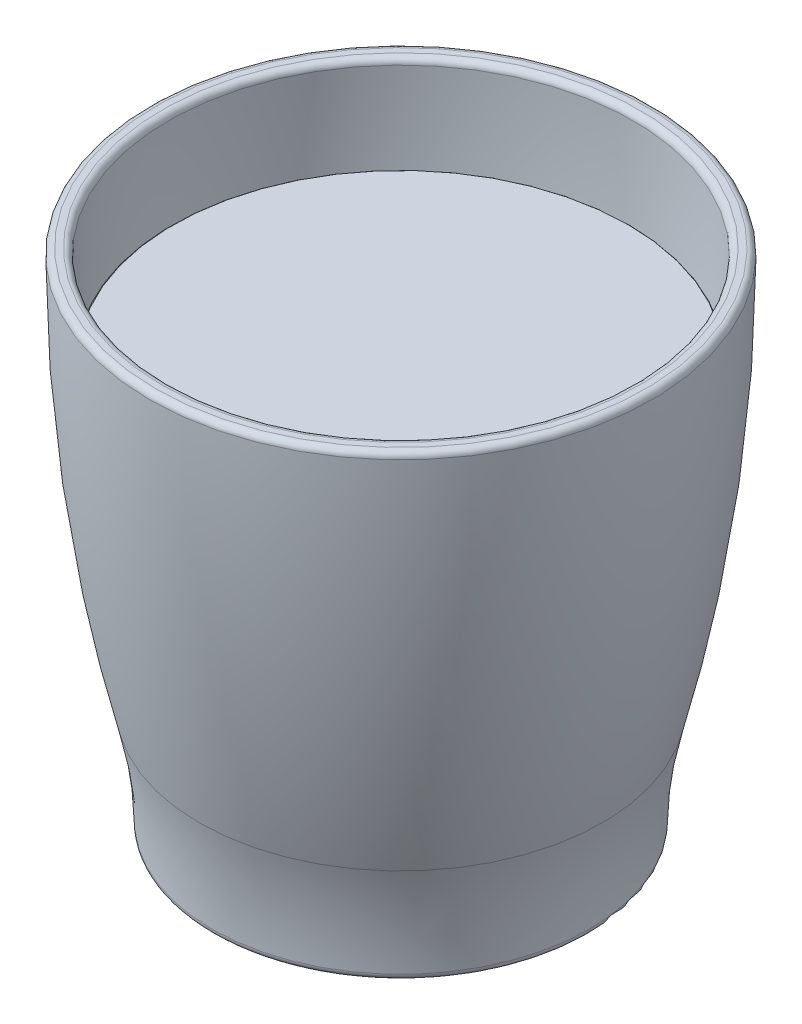
ISO-10303-21;
HEADER;
FILE_DESCRIPTION(('STEP AP214'),'2;1');
FILE_NAME('part.step','',(''),(''),'','','');
FILE_SCHEMA(('AUTOMOTIVE_DESIGN { 1 0 10303 214 1 1 1 1 }'));
ENDSEC;
DATA;
#1=APPLICATION_CONTEXT('core data for automotive mechanical design processes');
#2=APPLICATION_PROTOCOL_DEFINITION('international standard','automotive_design',2000,#1);
#3=PRODUCT_CONTEXT('',#1,'mechanical');
#4=PRODUCT('Part','Part','',(#3));
#5=PRODUCT_RELATED_PRODUCT_CATEGORY('part','',(#4));
#6=PRODUCT_DEFINITION_FORMATION('','',#4);
#7=PRODUCT_DEFINITION_CONTEXT('part definition',#1,'design');
#8=PRODUCT_DEFINITION('design','',#6,#7);
#9=PRODUCT_DEFINITION_SHAPE('','',#8);
#10=(LENGTH_UNIT() NAMED_UNIT(*) SI_UNIT(.MILLI.,.METRE.));
#11=(NAMED_UNIT(*) PLANE_ANGLE_UNIT() SI_UNIT($,.RADIAN.));
#12=(NAMED_UNIT(*) SI_UNIT($,.STERADIAN.) SOLID_ANGLE_UNIT());
#13=UNCERTAINTY_MEASURE_WITH_UNIT(LENGTH_MEASURE(1.E-05),#10,'distance_accuracy_value','');
#14=(GEOMETRIC_REPRESENTATION_CONTEXT(3) GLOBAL_UNCERTAINTY_ASSIGNED_CONTEXT((#13)) GLOBAL_UNIT_ASSIGNED_CONTEXT((#10,
#11,#12)) REPRESENTATION_CONTEXT('',''));
#15=CARTESIAN_POINT('',(0.,0.,0.));
#16=DIRECTION('',(0.,0.,1.));
#17=DIRECTION('',(1.,0.,0.));
#18=AXIS2_PLACEMENT_3D('',#15,#16,#17);
#19=CARTESIAN_POINT('',(0.,79.9999999999992,0.));
#20=DIRECTION('',(0.,-1.,0.));
#21=DIRECTION('',(0.,0.,-1.));
#22=AXIS2_PLACEMENT_3D('',#19,#20,#21);
#23=DEGENERATE_TOROIDAL_SURFACE('',#22,217.427109120294,254.227109120296,.F.);
#24=CARTESIAN_POINT('',(0.,64.8940580916171,0.));
#25=DIRECTION('',(0.,1.,0.));
#26=DIRECTION('',(0.,0.,1.));
#27=AXIS2_PLACEMENT_3D('',#24,#25,#26);
#28=CIRCLE('',#27,36.3508125567568);
#29=CARTESIAN_POINT('',(0.,64.8940580916171,36.3508125567568));
#30=VERTEX_POINT('',#29);
#31=EDGE_CURVE('E47',#30,#30,#28,.F.);
#32=ORIENTED_EDGE('',*,*,#31,.T.);
#33=EDGE_LOOP('',(#32));
#34=FACE_BOUND('',#33,.T.);
#35=CARTESIAN_POINT('',(0.,17.4936707648138,0.));
#36=DIRECTION('',(0.,-1.,0.));
#37=DIRECTION('',(0.,0.,-1.));
#38=AXIS2_PLACEMENT_3D('',#35,#36,#37);
#39=CIRCLE('',#38,28.9960671785382);
#40=CARTESIAN_POINT('',(0.,17.4936707648138,-28.9960671785382));
#41=VERTEX_POINT('',#40);
#42=EDGE_CURVE('E51',#41,#41,#39,.T.);
#43=ORIENTED_EDGE('',*,*,#42,.F.);
#44=EDGE_LOOP('',(#43));
#45=FACE_BOUND('',#44,.T.);
#46=ADVANCED_FACE('F40',(#34,#45),#23,.F.);
#47=CARTESIAN_POINT('',(0.,0.,0.));
#48=DIRECTION('',(0.,-1.,0.));
#49=DIRECTION('',(0.,0.,-1.));
#50=AXIS2_PLACEMENT_3D('',#47,#48,#49);
#51=TOROIDAL_SURFACE('',#50,97.9626177301071,71.1506402768788);
#52=CARTESIAN_POINT('',(0.,15.5049828231198,0.));
#53=DIRECTION('',(0.,-1.,0.));
#54=DIRECTION('',(0.,0.,-1.));
#55=AXIS2_PLACEMENT_3D('',#52,#53,#54);
#56=CIRCLE('',#55,28.5219299493502);
#57=CARTESIAN_POINT('',(0.,15.5049828231198,-28.5219299493502));
#58=VERTEX_POINT('',#57);
#59=EDGE_CURVE('E55',#58,#58,#56,.T.);
#60=ORIENTED_EDGE('',*,*,#59,.F.);
#61=EDGE_LOOP('',(#60));
#62=FACE_BOUND('',#61,.T.);
#63=ORIENTED_EDGE('',*,*,#42,.T.);
#64=EDGE_LOOP('',(#63));
#65=FACE_BOUND('',#64,.T.);
#66=ADVANCED_FACE('F78',(#62,#65),#51,.F.);
#67=CARTESIAN_POINT('',(0.,17.6405761371824,0.));
#68=DIRECTION('',(0.,-1.,0.));
#69=DIRECTION('',(0.,0.,-1.));
#70=AXIS2_PLACEMENT_3D('',#67,#68,#69);
#71=TOROIDAL_SURFACE('',#70,18.957451856065,9.8);
#72=CARTESIAN_POINT('',(0.,8.04187579238576,0.));
#73=DIRECTION('',(0.,-1.,0.));
#74=DIRECTION('',(0.,0.,-1.));
#75=AXIS2_PLACEMENT_3D('',#72,#73,#74);
#76=CIRCLE('',#75,16.9813567948898);
#77=CARTESIAN_POINT('',(0.,8.04187579238576,-16.9813567948898));
#78=VERTEX_POINT('',#77);
#79=EDGE_CURVE('E60',#78,#78,#76,.T.);
#80=ORIENTED_EDGE('',*,*,#79,.F.);
#81=EDGE_LOOP('',(#80));
#82=FACE_BOUND('',#81,.T.);
#83=ORIENTED_EDGE('',*,*,#59,.T.);
#84=EDGE_LOOP('',(#83));
#85=FACE_BOUND('',#84,.T.);
#86=ADVANCED_FACE('F72',(#82,#85),#71,.T.);
#87=CARTESIAN_POINT('',(0.,-27.2680334224813,0.));
#88=DIRECTION('',(0.,-1.,0.));
#89=DIRECTION('',(0.,0.,-1.));
#90=AXIS2_PLACEMENT_3D('',#87,#88,#89);
#91=DEGENERATE_TOROIDAL_SURFACE('',#90,9.71206671356828,36.0504128554522,.T.);
#92=CARTESIAN_POINT('',(0.,8.07614027613722,0.));
#93=DIRECTION('',(0.,-1.,0.));
#94=DIRECTION('',(0.,0.,-1.));
#95=AXIS2_PLACEMENT_3D('',#92,#93,#94);
#96=CIRCLE('',#95,16.8128872725203);
#97=CARTESIAN_POINT('',(0.,8.07614027613722,-16.8128872725203));
#98=VERTEX_POINT('',#97);
#99=EDGE_CURVE('E63',#98,#98,#96,.T.);
#100=ORIENTED_EDGE('',*,*,#99,.F.);
#101=EDGE_LOOP('',(#100));
#102=FACE_BOUND('',#101,.T.);
#103=ORIENTED_EDGE('',*,*,#79,.T.);
#104=EDGE_LOOP('',(#103));
#105=FACE_BOUND('',#104,.T.);
#106=ADVANCED_FACE('F69',(#102,#105),#91,.F.);
#107=CARTESIAN_POINT('',(-16.8128872725203,8.07614027613722,0.));
#108=DIRECTION('',(0.,1.,0.));
#109=DIRECTION('',(0.,0.,1.));
#110=AXIS2_PLACEMENT_3D('',#107,#108,#109);
#111=PLANE('',#110);
#112=ORIENTED_EDGE('',*,*,#99,.T.);
#113=EDGE_LOOP('',(#112));
#114=FACE_BOUND('',#113,.T.);
#115=ADVANCED_FACE('F67',(#114),#111,.F.);
#116=CARTESIAN_POINT('',(-36.3570964789962,65.,0.));
#117=DIRECTION('',(0.,-1.,0.));
#118=DIRECTION('',(0.,0.,-1.));
#119=AXIS2_PLACEMENT_3D('',#116,#117,#118);
#120=PLANE('',#119);
#121=CARTESIAN_POINT('',(0.,65.,0.));
#122=DIRECTION('',(0.,-1.,0.));
#123=DIRECTION('',(0.,0.,-1.));
#124=AXIS2_PLACEMENT_3D('',#121,#122,#123);
#125=CIRCLE('',#124,36.2509892442253);
#126=CARTESIAN_POINT('',(0.,65.,-36.2509892442253));
#127=VERTEX_POINT('',#126);
#128=EDGE_CURVE('E11',#127,#127,#125,.F.);
#129=ORIENTED_EDGE('',*,*,#128,.T.);
#130=EDGE_LOOP('',(#129));
#131=FACE_BOUND('',#130,.T.);
#132=ADVANCED_FACE('F93',(#131),#120,.F.);
#133=CARTESIAN_POINT('',(0.,64.9,0.));
#134=DIRECTION('',(0.,-1.,0.));
#135=DIRECTION('',(0.,0.,-1.));
#136=AXIS2_PLACEMENT_3D('',#133,#134,#135);
#137=TOROIDAL_SURFACE('',#136,36.2509892442253,0.1);
#138=ORIENTED_EDGE('',*,*,#128,.F.);
#139=EDGE_LOOP('',(#138));
#140=FACE_BOUND('',#139,.T.);
#141=ORIENTED_EDGE('',*,*,#31,.F.);
#142=EDGE_LOOP('',(#141));
#143=FACE_BOUND('',#142,.T.);
#144=ADVANCED_FACE('F42',(#140,#143),#137,.T.);
#145=CLOSED_SHELL('',(#46,#66,#86,#106,#115,#132,#144));
#146=MANIFOLD_SOLID_BREP('B2',#145);
#147=CARTESIAN_POINT('',(0.,79.9999999999992,0.));
#148=DIRECTION('',(0.,1.,0.));
#149=DIRECTION('',(0.,0.,1.));
#150=AXIS2_PLACEMENT_3D('',#147,#148,#149);
#151=DEGENERATE_TOROIDAL_SURFACE('',#150,217.427109120294,257.427109120295,.F.);
#152=CARTESIAN_POINT('',(0.,78.9961002563129,0.));
#153=DIRECTION('',(0.,1.,0.));
#154=DIRECTION('',(0.,0.,1.));
#155=AXIS2_PLACEMENT_3D('',#152,#153,#154);
#156=CIRCLE('',#155,39.9980425167144);
#157=CARTESIAN_POINT('',(0.,78.9961002563129,39.9980425167144));
#158=VERTEX_POINT('',#157);
#159=EDGE_CURVE('E39',#158,#158,#156,.F.);
#160=ORIENTED_EDGE('',*,*,#159,.T.);
#161=EDGE_LOOP('',(#160));
#162=FACE_BOUND('',#161,.T.);
#163=CARTESIAN_POINT('',(0.,16.7068929335875,0.));
#164=DIRECTION('',(0.,1.,0.));
#165=DIRECTION('',(0.,0.,1.));
#166=AXIS2_PLACEMENT_3D('',#163,#164,#165);
#167=CIRCLE('',#166,32.0978377445684);
#168=CARTESIAN_POINT('',(0.,16.7068929335875,32.0978377445684));
#169=VERTEX_POINT('',#168);
#170=EDGE_CURVE('E172',#169,#169,#167,.T.);
#171=ORIENTED_EDGE('',*,*,#170,.T.);
#172=EDGE_LOOP('',(#171));
#173=FACE_BOUND('',#172,.T.);
#174=ADVANCED_FACE('F140',(#162,#173),#151,.F.);
#175=CARTESIAN_POINT('',(0.,0.,0.));
#176=DIRECTION('',(0.,1.,0.));
#177=DIRECTION('',(0.,0.,1.));
#178=AXIS2_PLACEMENT_3D('',#175,#176,#177);
#179=TOROIDAL_SURFACE('',#178,97.9626177301071,67.9506402768788);
#180=CARTESIAN_POINT('',(0.,0.985496871443335,0.));
#181=DIRECTION('',(0.,-1.,0.));
#182=DIRECTION('',(0.,0.,-1.));
#183=AXIS2_PLACEMENT_3D('',#180,#181,#182);
#184=CIRCLE('',#183,30.0191242229716);
#185=CARTESIAN_POINT('',(0.,0.985496871443335,-30.0191242229716));
#186=VERTEX_POINT('',#185);
#187=EDGE_CURVE('E169',#186,#186,#184,.F.);
#188=ORIENTED_EDGE('',*,*,#187,.T.);
#189=EDGE_LOOP('',(#188));
#190=FACE_BOUND('',#189,.T.);
#191=ORIENTED_EDGE('',*,*,#170,.F.);
#192=EDGE_LOOP('',(#191));
#193=FACE_BOUND('',#192,.T.);
#194=ADVANCED_FACE('F208',(#190,#193),#179,.F.);
#195=CARTESIAN_POINT('',(-30.0119774532283,0.,0.));
#196=DIRECTION('',(0.,-1.,0.));
#197=DIRECTION('',(0.,0.,-1.));
#198=AXIS2_PLACEMENT_3D('',#195,#196,#197);
#199=PLANE('',#198);
#200=CARTESIAN_POINT('',(0.,0.,0.));
#201=DIRECTION('',(0.,-1.,0.));
#202=DIRECTION('',(0.,0.,-1.));
#203=AXIS2_PLACEMENT_3D('',#200,#201,#202);
#204=CIRCLE('',#203,29.0192293988716);
#205=CARTESIAN_POINT('',(0.,0.,-29.0192293988716));
#206=VERTEX_POINT('',#205);
#207=EDGE_CURVE('E163',#206,#206,#204,.T.);
#208=ORIENTED_EDGE('',*,*,#207,.T.);
#209=EDGE_LOOP('',(#208));
#210=FACE_BOUND('',#209,.T.);
#211=CARTESIAN_POINT('',(0.,0.,0.));
#212=DIRECTION('',(0.,-1.,0.));
#213=DIRECTION('',(0.,0.,-1.));
#214=AXIS2_PLACEMENT_3D('',#211,#212,#213);
#215=CIRCLE('',#214,24.3874571849743);
#216=CARTESIAN_POINT('',(0.,0.,-24.3874571849743));
#217=VERTEX_POINT('',#216);
#218=EDGE_CURVE('E166',#217,#217,#215,.F.);
#219=ORIENTED_EDGE('',*,*,#218,.T.);
#220=EDGE_LOOP('',(#219));
#221=FACE_BOUND('',#220,.T.);
#222=ADVANCED_FACE('F213',(#210,#221),#199,.T.);
#223=CARTESIAN_POINT('',(0.,-27.2680334224813,0.));
#224=DIRECTION('',(0.,1.,0.));
#225=DIRECTION('',(0.,0.,1.));
#226=AXIS2_PLACEMENT_3D('',#223,#224,#225);
#227=DEGENERATE_TOROIDAL_SURFACE('',#226,9.71206671356828,30.8504128554522,.T.);
#228=CARTESIAN_POINT('',(0.,0.112475133343764,0.));
#229=DIRECTION('',(0.,-1.,0.));
#230=DIRECTION('',(0.,0.,-1.));
#231=AXIS2_PLACEMENT_3D('',#228,#229,#230);
#232=CIRCLE('',#231,23.9266973656901);
#233=CARTESIAN_POINT('',(0.,0.112475133343764,-23.9266973656901));
#234=VERTEX_POINT('',#233);
#235=EDGE_CURVE('E160',#234,#234,#232,.T.);
#236=ORIENTED_EDGE('',*,*,#235,.T.);
#237=EDGE_LOOP('',(#236));
#238=FACE_BOUND('',#237,.T.);
#239=CARTESIAN_POINT('',(0.,2.87614027613722,0.));
#240=DIRECTION('',(0.,1.,0.));
#241=DIRECTION('',(0.,0.,1.));
#242=AXIS2_PLACEMENT_3D('',#239,#240,#241);
#243=CIRCLE('',#242,16.275355933111);
#244=CARTESIAN_POINT('',(0.,2.87614027613722,16.275355933111));
#245=VERTEX_POINT('',#244);
#246=EDGE_CURVE('E175',#245,#245,#243,.T.);
#247=ORIENTED_EDGE('',*,*,#246,.T.);
#248=EDGE_LOOP('',(#247));
#249=FACE_BOUND('',#248,.T.);
#250=ADVANCED_FACE('F271',(#238,#249),#227,.F.);
#251=CARTESIAN_POINT('',(-16.275355933111,2.87614027613722,0.));
#252=DIRECTION('',(0.,-1.,0.));
#253=DIRECTION('',(0.,0.,-1.));
#254=AXIS2_PLACEMENT_3D('',#251,#252,#253);
#255=PLANE('',#254);
#256=ORIENTED_EDGE('',*,*,#246,.F.);
#257=EDGE_LOOP('',(#256));
#258=FACE_BOUND('',#257,.T.);
#259=ADVANCED_FACE('F276',(#258),#255,.T.);
#260=CARTESIAN_POINT('',(-16.7929675706416,7.87614027613722,0.));
#261=DIRECTION('',(0.,1.,0.));
#262=DIRECTION('',(0.,0.,1.));
#263=AXIS2_PLACEMENT_3D('',#260,#261,#262);
#264=PLANE('',#263);
#265=CARTESIAN_POINT('',(0.,7.87614027613722,0.));
#266=DIRECTION('',(0.,1.,0.));
#267=DIRECTION('',(0.,0.,1.));
#268=AXIS2_PLACEMENT_3D('',#265,#266,#267);
#269=CIRCLE('',#268,16.7929675706416);
#270=CARTESIAN_POINT('',(0.,7.87614027613722,16.7929675706416));
#271=VERTEX_POINT('',#270);
#272=EDGE_CURVE('E178',#271,#271,#269,.T.);
#273=ORIENTED_EDGE('',*,*,#272,.T.);
#274=EDGE_LOOP('',(#273));
#275=FACE_BOUND('',#274,.T.);
#276=ADVANCED_FACE('F321',(#275),#264,.T.);
#277=CARTESIAN_POINT('',(0.,-27.2680334224813,0.));
#278=DIRECTION('',(0.,1.,0.));
#279=DIRECTION('',(0.,0.,1.));
#280=AXIS2_PLACEMENT_3D('',#277,#278,#279);
#281=DEGENERATE_TOROIDAL_SURFACE('',#280,9.71206671356828,35.8504128554522,.T.);
#282=CARTESIAN_POINT('',(0.,7.8459839486144,0.));
#283=DIRECTION('',(0.,1.,0.));
#284=DIRECTION('',(0.,0.,1.));
#285=AXIS2_PLACEMENT_3D('',#282,#283,#284);
#286=CIRCLE('',#285,16.9410283242536);
#287=CARTESIAN_POINT('',(0.,7.8459839486144,16.9410283242536));
#288=VERTEX_POINT('',#287);
#289=EDGE_CURVE('E181',#288,#288,#286,.T.);
#290=ORIENTED_EDGE('',*,*,#289,.T.);
#291=EDGE_LOOP('',(#290));
#292=FACE_BOUND('',#291,.T.);
#293=ORIENTED_EDGE('',*,*,#272,.F.);
#294=EDGE_LOOP('',(#293));
#295=FACE_BOUND('',#294,.T.);
#296=ADVANCED_FACE('F311',(#292,#295),#281,.T.);
#297=CARTESIAN_POINT('',(0.,17.6405761371824,0.));
#298=DIRECTION('',(0.,1.,0.));
#299=DIRECTION('',(0.,0.,1.));
#300=AXIS2_PLACEMENT_3D('',#297,#298,#299);
#301=TOROIDAL_SURFACE('',#300,18.957451856065,9.99999999999998);
#302=CARTESIAN_POINT('',(0.,15.4613992860981,0.));
#303=DIRECTION('',(0.,1.,0.));
#304=DIRECTION('',(0.,0.,1.));
#305=AXIS2_PLACEMENT_3D('',#302,#303,#304);
#306=CIRCLE('',#305,28.7171233798253);
#307=CARTESIAN_POINT('',(0.,15.4613992860981,28.7171233798253));
#308=VERTEX_POINT('',#307);
#309=EDGE_CURVE('E184',#308,#308,#306,.T.);
#310=ORIENTED_EDGE('',*,*,#309,.T.);
#311=EDGE_LOOP('',(#310));
#312=FACE_BOUND('',#311,.T.);
#313=ORIENTED_EDGE('',*,*,#289,.F.);
#314=EDGE_LOOP('',(#313));
#315=FACE_BOUND('',#314,.T.);
#316=ADVANCED_FACE('F205',(#312,#315),#301,.F.);
#317=CARTESIAN_POINT('',(0.,0.,0.));
#318=DIRECTION('',(0.,1.,0.));
#319=DIRECTION('',(0.,0.,1.));
#320=AXIS2_PLACEMENT_3D('',#317,#318,#319);
#321=TOROIDAL_SURFACE('',#320,97.9626177301071,70.9506402768788);
#322=CARTESIAN_POINT('',(0.,17.4444971503623,0.));
#323=DIRECTION('',(0.,1.,0.));
#324=DIRECTION('',(0.,0.,1.));
#325=AXIS2_PLACEMENT_3D('',#322,#323,#324);
#326=CIRCLE('',#325,29.1899278389151);
#327=CARTESIAN_POINT('',(0.,17.4444971503623,29.1899278389151));
#328=VERTEX_POINT('',#327);
#329=EDGE_CURVE('E187',#328,#328,#326,.T.);
#330=ORIENTED_EDGE('',*,*,#329,.T.);
#331=EDGE_LOOP('',(#330));
#332=FACE_BOUND('',#331,.T.);
#333=ORIENTED_EDGE('',*,*,#309,.F.);
#334=EDGE_LOOP('',(#333));
#335=FACE_BOUND('',#334,.T.);
#336=ADVANCED_FACE('F191',(#332,#335),#321,.T.);
#337=CARTESIAN_POINT('',(0.,79.9999999999992,0.));
#338=DIRECTION('',(0.,1.,0.));
#339=DIRECTION('',(0.,0.,1.));
#340=AXIS2_PLACEMENT_3D('',#337,#338,#339);
#341=DEGENERATE_TOROIDAL_SURFACE('',#340,217.427109120294,254.427109120296,.F.);
#342=CARTESIAN_POINT('',(0.,79.0039150112274,0.));
#343=DIRECTION('',(0.,1.,0.));
#344=DIRECTION('',(0.,0.,1.));
#345=AXIS2_PLACEMENT_3D('',#342,#343,#344);
#346=CIRCLE('',#345,36.9980501505729);
#347=CARTESIAN_POINT('',(0.,79.0039150112274,36.9980501505729));
#348=VERTEX_POINT('',#347);
#349=EDGE_CURVE('E155',#348,#348,#346,.T.);
#350=ORIENTED_EDGE('',*,*,#349,.T.);
#351=EDGE_LOOP('',(#350));
#352=FACE_BOUND('',#351,.T.);
#353=ORIENTED_EDGE('',*,*,#329,.F.);
#354=EDGE_LOOP('',(#353));
#355=FACE_BOUND('',#354,.T.);
#356=ADVANCED_FACE('F194',(#352,#355),#341,.T.);
#357=CARTESIAN_POINT('',(-40.,80.,0.));
#358=DIRECTION('',(0.,1.,0.));
#359=DIRECTION('',(0.,0.,1.));
#360=AXIS2_PLACEMENT_3D('',#357,#358,#359);
#361=PLANE('',#360);
#362=CARTESIAN_POINT('',(0.,80.,0.));
#363=DIRECTION('',(0.,1.,0.));
#364=DIRECTION('',(0.,0.,1.));
#365=AXIS2_PLACEMENT_3D('',#362,#363,#364);
#366=CIRCLE('',#365,37.9980424868871);
#367=CARTESIAN_POINT('',(0.,80.,37.9980424868871));
#368=VERTEX_POINT('',#367);
#369=EDGE_CURVE('E147',#368,#368,#366,.F.);
#370=ORIENTED_EDGE('',*,*,#369,.T.);
#371=EDGE_LOOP('',(#370));
#372=FACE_BOUND('',#371,.T.);
#373=CARTESIAN_POINT('',(0.,80.,0.));
#374=DIRECTION('',(0.,1.,0.));
#375=DIRECTION('',(0.,0.,1.));
#376=AXIS2_PLACEMENT_3D('',#373,#374,#375);
#377=CIRCLE('',#376,38.9980501207438);
#378=CARTESIAN_POINT('',(0.,80.,38.9980501207438));
#379=VERTEX_POINT('',#378);
#380=EDGE_CURVE('E151',#379,#379,#377,.T.);
#381=ORIENTED_EDGE('',*,*,#380,.T.);
#382=EDGE_LOOP('',(#381));
#383=FACE_BOUND('',#382,.T.);
#384=ADVANCED_FACE('F196',(#372,#383),#361,.T.);
#385=CARTESIAN_POINT('',(0.,1.,0.));
#386=DIRECTION('',(0.,1.,0.));
#387=DIRECTION('',(0.,0.,1.));
#388=AXIS2_PLACEMENT_3D('',#385,#386,#387);
#389=TOROIDAL_SURFACE('',#388,29.0192293988716,1.);
#390=ORIENTED_EDGE('',*,*,#207,.F.);
#391=EDGE_LOOP('',(#390));
#392=FACE_BOUND('',#391,.T.);
#393=ORIENTED_EDGE('',*,*,#187,.F.);
#394=EDGE_LOOP('',(#393));
#395=FACE_BOUND('',#394,.T.);
#396=ADVANCED_FACE('F203',(#392,#395),#389,.T.);
#397=CARTESIAN_POINT('',(0.,1.,0.));
#398=DIRECTION('',(0.,-1.,0.));
#399=DIRECTION('',(0.,0.,-1.));
#400=AXIS2_PLACEMENT_3D('',#397,#398,#399);
#401=TOROIDAL_SURFACE('',#400,24.3874571849743,1.);
#402=ORIENTED_EDGE('',*,*,#235,.F.);
#403=EDGE_LOOP('',(#402));
#404=FACE_BOUND('',#403,.T.);
#405=ORIENTED_EDGE('',*,*,#218,.F.);
#406=EDGE_LOOP('',(#405));
#407=FACE_BOUND('',#406,.T.);
#408=ADVANCED_FACE('F221',(#404,#407),#401,.T.);
#409=CARTESIAN_POINT('',(0.,79.,0.));
#410=DIRECTION('',(0.,1.,0.));
#411=DIRECTION('',(0.,0.,1.));
#412=AXIS2_PLACEMENT_3D('',#409,#410,#411);
#413=TOROIDAL_SURFACE('',#412,37.9980424868871,1.);
#414=ORIENTED_EDGE('',*,*,#369,.F.);
#415=EDGE_LOOP('',(#414));
#416=FACE_BOUND('',#415,.T.);
#417=ORIENTED_EDGE('',*,*,#349,.F.);
#418=EDGE_LOOP('',(#417));
#419=FACE_BOUND('',#418,.T.);
#420=ADVANCED_FACE('F224',(#416,#419),#413,.T.);
#421=CARTESIAN_POINT('',(0.,79.,0.));
#422=DIRECTION('',(0.,1.,0.));
#423=DIRECTION('',(0.,0.,1.));
#424=AXIS2_PLACEMENT_3D('',#421,#422,#423);
#425=TOROIDAL_SURFACE('',#424,38.9980501207438,1.);
#426=ORIENTED_EDGE('',*,*,#159,.F.);
#427=EDGE_LOOP('',(#426));
#428=FACE_BOUND('',#427,.T.);
#429=ORIENTED_EDGE('',*,*,#380,.F.);
#430=EDGE_LOOP('',(#429));
#431=FACE_BOUND('',#430,.T.);
#432=ADVANCED_FACE('F142',(#428,#431),#425,.T.);
#433=CLOSED_SHELL('',(#174,#194,#222,#250,#259,#276,#296,#316,#336,#356,#384,#396,#408,#420,#432));
#434=MANIFOLD_SOLID_BREP('B6',#433);
#435=ADVANCED_BREP_SHAPE_REPRESENTATION('',(#18,#146,#434),#14);
#436=SHAPE_DEFINITION_REPRESENTATION(#9,#435);
ENDSEC;
END-ISO-10303-21;
